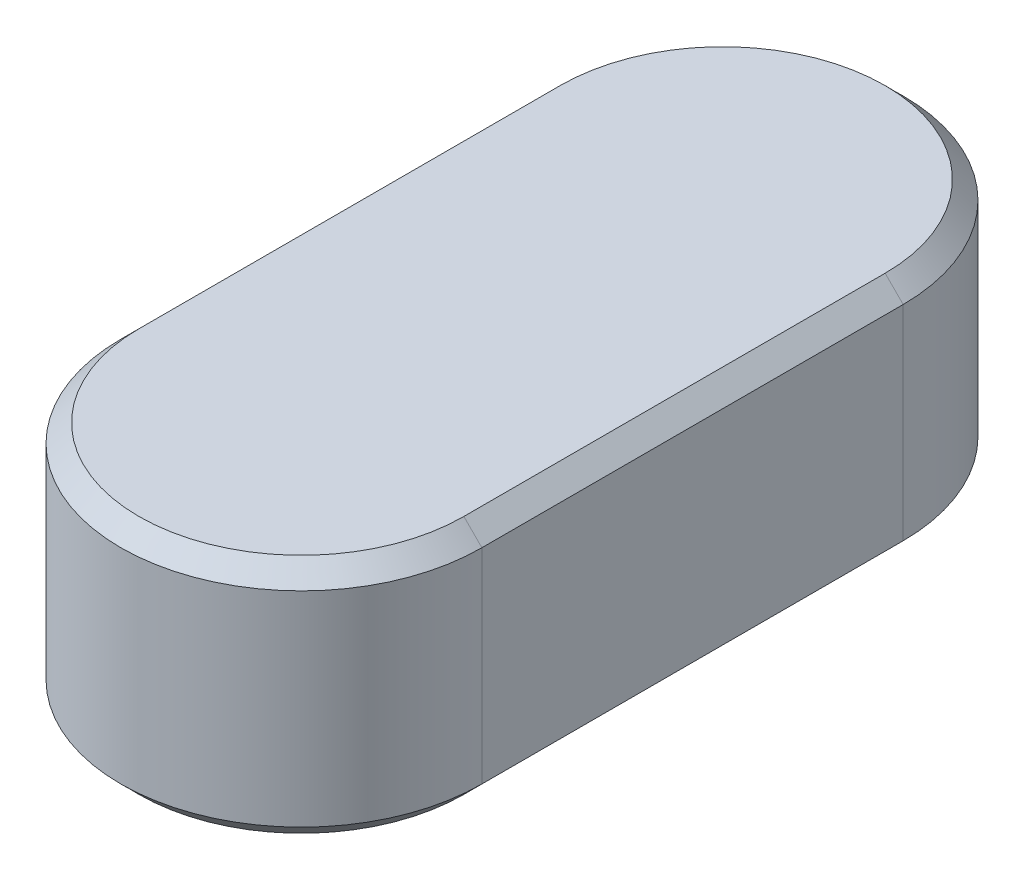
ISO-10303-21;
HEADER;
FILE_DESCRIPTION(('STEP AP214'),'2;1');
FILE_NAME('part.step','',(''),(''),'','','');
FILE_SCHEMA(('AUTOMOTIVE_DESIGN { 1 0 10303 214 1 1 1 1 }'));
ENDSEC;
DATA;
#1=APPLICATION_CONTEXT('core data for automotive mechanical design processes');
#2=APPLICATION_PROTOCOL_DEFINITION('international standard','automotive_design',2000,#1);
#3=PRODUCT_CONTEXT('',#1,'mechanical');
#4=PRODUCT('Part','Part','',(#3));
#5=PRODUCT_RELATED_PRODUCT_CATEGORY('part','',(#4));
#6=PRODUCT_DEFINITION_FORMATION('','',#4);
#7=PRODUCT_DEFINITION_CONTEXT('part definition',#1,'design');
#8=PRODUCT_DEFINITION('design','',#6,#7);
#9=PRODUCT_DEFINITION_SHAPE('','',#8);
#10=(LENGTH_UNIT() NAMED_UNIT(*) SI_UNIT(.MILLI.,.METRE.));
#11=(NAMED_UNIT(*) PLANE_ANGLE_UNIT() SI_UNIT($,.RADIAN.));
#12=(NAMED_UNIT(*) SI_UNIT($,.STERADIAN.) SOLID_ANGLE_UNIT());
#13=UNCERTAINTY_MEASURE_WITH_UNIT(LENGTH_MEASURE(1.E-05),#10,'distance_accuracy_value','');
#14=(GEOMETRIC_REPRESENTATION_CONTEXT(3) GLOBAL_UNCERTAINTY_ASSIGNED_CONTEXT((#13)) GLOBAL_UNIT_ASSIGNED_CONTEXT((#10,
#11,#12)) REPRESENTATION_CONTEXT('',''));
#15=CARTESIAN_POINT('',(0.,0.,0.));
#16=DIRECTION('',(0.,0.,1.));
#17=DIRECTION('',(1.,0.,0.));
#18=AXIS2_PLACEMENT_3D('',#15,#16,#17);
#19=CARTESIAN_POINT('',(0.,8.,0.));
#20=DIRECTION('',(0.,-1.,0.));
#21=DIRECTION('',(0.,0.,-1.));
#22=AXIS2_PLACEMENT_3D('',#19,#20,#21);
#23=CYLINDRICAL_SURFACE('',#22,6.);
#24=DIRECTION('',(0.,-1.,0.));
#25=VECTOR('',#24,1.);
#26=CARTESIAN_POINT('',(6.,8.,0.));
#27=LINE('',#26,#25);
#28=CARTESIAN_POINT('',(6.,7.4,0.));
#29=VERTEX_POINT('',#28);
#30=CARTESIAN_POINT('',(6.,0.600000000000003,0.));
#31=VERTEX_POINT('',#30);
#32=EDGE_CURVE('E137',#29,#31,#27,.T.);
#33=ORIENTED_EDGE('',*,*,#32,.F.);
#34=CARTESIAN_POINT('',(0.,7.4,0.));
#35=DIRECTION('',(0.,-1.,0.));
#36=DIRECTION('',(0.,0.,-1.));
#37=AXIS2_PLACEMENT_3D('',#34,#35,#36);
#38=CIRCLE('',#37,6.);
#39=CARTESIAN_POINT('',(-6.,7.4,0.));
#40=VERTEX_POINT('',#39);
#41=EDGE_CURVE('E140',#29,#40,#38,.T.);
#42=ORIENTED_EDGE('',*,*,#41,.T.);
#43=DIRECTION('',(0.,-1.,0.));
#44=VECTOR('',#43,1.);
#45=CARTESIAN_POINT('',(-6.,8.,0.));
#46=LINE('',#45,#44);
#47=CARTESIAN_POINT('',(-6.,0.600000000000003,0.));
#48=VERTEX_POINT('',#47);
#49=EDGE_CURVE('E146',#40,#48,#46,.T.);
#50=ORIENTED_EDGE('',*,*,#49,.T.);
#51=CARTESIAN_POINT('',(0.,0.600000000000003,0.));
#52=DIRECTION('',(0.,-1.,0.));
#53=DIRECTION('',(0.,0.,-1.));
#54=AXIS2_PLACEMENT_3D('',#51,#52,#53);
#55=CIRCLE('',#54,6.);
#56=EDGE_CURVE('E193',#48,#31,#55,.F.);
#57=ORIENTED_EDGE('',*,*,#56,.T.);
#58=EDGE_LOOP('',(#33,#42,#50,#57));
#59=FACE_BOUND('',#58,.T.);
#60=ADVANCED_FACE('F45',(#59),#23,.T.);
#61=CARTESIAN_POINT('',(6.,8.,0.));
#62=DIRECTION('',(-1.,0.,0.));
#63=DIRECTION('',(0.,0.,1.));
#64=AXIS2_PLACEMENT_3D('',#61,#62,#63);
#65=PLANE('',#64);
#66=DIRECTION('',(0.,-1.,0.));
#67=VECTOR('',#66,1.);
#68=CARTESIAN_POINT('',(6.,8.,-14.));
#69=LINE('',#68,#67);
#70=CARTESIAN_POINT('',(6.,7.4,-14.));
#71=VERTEX_POINT('',#70);
#72=CARTESIAN_POINT('',(6.,0.600000000000003,-14.));
#73=VERTEX_POINT('',#72);
#74=EDGE_CURVE('E211',#71,#73,#69,.T.);
#75=ORIENTED_EDGE('',*,*,#74,.F.);
#76=DIRECTION('',(0.,0.,1.));
#77=VECTOR('',#76,1.);
#78=CARTESIAN_POINT('',(6.,7.4,0.));
#79=LINE('',#78,#77);
#80=EDGE_CURVE('E179',#71,#29,#79,.T.);
#81=ORIENTED_EDGE('',*,*,#80,.T.);
#82=ORIENTED_EDGE('',*,*,#32,.T.);
#83=DIRECTION('',(0.,0.,-1.));
#84=VECTOR('',#83,1.);
#85=CARTESIAN_POINT('',(6.,0.600000000000003,-14.));
#86=LINE('',#85,#84);
#87=EDGE_CURVE('E182',#31,#73,#86,.T.);
#88=ORIENTED_EDGE('',*,*,#87,.T.);
#89=EDGE_LOOP('',(#75,#81,#82,#88));
#90=FACE_BOUND('',#89,.T.);
#91=ADVANCED_FACE('F236',(#90),#65,.F.);
#92=CARTESIAN_POINT('',(0.,8.,-14.));
#93=DIRECTION('',(0.,-1.,0.));
#94=DIRECTION('',(0.,0.,-1.));
#95=AXIS2_PLACEMENT_3D('',#92,#93,#94);
#96=CYLINDRICAL_SURFACE('',#95,6.);
#97=DIRECTION('',(0.,-1.,0.));
#98=VECTOR('',#97,1.);
#99=CARTESIAN_POINT('',(-6.,8.,-14.));
#100=LINE('',#99,#98);
#101=CARTESIAN_POINT('',(-6.,7.4,-14.));
#102=VERTEX_POINT('',#101);
#103=CARTESIAN_POINT('',(-6.,0.600000000000003,-14.));
#104=VERTEX_POINT('',#103);
#105=EDGE_CURVE('E215',#102,#104,#100,.T.);
#106=ORIENTED_EDGE('',*,*,#105,.F.);
#107=CARTESIAN_POINT('',(0.,7.4,-14.));
#108=DIRECTION('',(0.,-1.,0.));
#109=DIRECTION('',(0.,0.,-1.));
#110=AXIS2_PLACEMENT_3D('',#107,#108,#109);
#111=CIRCLE('',#110,6.);
#112=EDGE_CURVE('E185',#102,#71,#111,.T.);
#113=ORIENTED_EDGE('',*,*,#112,.T.);
#114=ORIENTED_EDGE('',*,*,#74,.T.);
#115=CARTESIAN_POINT('',(0.,0.600000000000003,-14.));
#116=DIRECTION('',(0.,-1.,0.));
#117=DIRECTION('',(0.,0.,-1.));
#118=AXIS2_PLACEMENT_3D('',#115,#116,#117);
#119=CIRCLE('',#118,6.);
#120=EDGE_CURVE('E188',#73,#104,#119,.F.);
#121=ORIENTED_EDGE('',*,*,#120,.T.);
#122=EDGE_LOOP('',(#106,#113,#114,#121));
#123=FACE_BOUND('',#122,.T.);
#124=ADVANCED_FACE('F234',(#123),#96,.T.);
#125=CARTESIAN_POINT('',(-6.,8.,0.));
#126=DIRECTION('',(1.,0.,0.));
#127=DIRECTION('',(0.,0.,-1.));
#128=AXIS2_PLACEMENT_3D('',#125,#126,#127);
#129=PLANE('',#128);
#130=ORIENTED_EDGE('',*,*,#49,.F.);
#131=DIRECTION('',(0.,0.,-1.));
#132=VECTOR('',#131,1.);
#133=CARTESIAN_POINT('',(-6.,7.4,0.));
#134=LINE('',#133,#132);
#135=EDGE_CURVE('E196',#40,#102,#134,.T.);
#136=ORIENTED_EDGE('',*,*,#135,.T.);
#137=ORIENTED_EDGE('',*,*,#105,.T.);
#138=DIRECTION('',(0.,0.,1.));
#139=VECTOR('',#138,1.);
#140=CARTESIAN_POINT('',(-6.,0.600000000000003,0.));
#141=LINE('',#140,#139);
#142=EDGE_CURVE('E200',#104,#48,#141,.T.);
#143=ORIENTED_EDGE('',*,*,#142,.T.);
#144=EDGE_LOOP('',(#130,#136,#137,#143));
#145=FACE_BOUND('',#144,.T.);
#146=ADVANCED_FACE('F225',(#145),#129,.F.);
#147=CARTESIAN_POINT('',(0.,8.,0.));
#148=DIRECTION('',(0.,-1.,0.));
#149=DIRECTION('',(0.,0.,-1.));
#150=AXIS2_PLACEMENT_3D('',#147,#148,#149);
#151=PLANE('',#150);
#152=CARTESIAN_POINT('',(0.,8.,-14.));
#153=DIRECTION('',(0.,-1.,0.));
#154=DIRECTION('',(0.,0.,-1.));
#155=AXIS2_PLACEMENT_3D('',#152,#153,#154);
#156=CIRCLE('',#155,5.4);
#157=CARTESIAN_POINT('',(5.4,8.,-14.));
#158=VERTEX_POINT('',#157);
#159=CARTESIAN_POINT('',(-5.4,8.,-14.));
#160=VERTEX_POINT('',#159);
#161=EDGE_CURVE('E125',#158,#160,#156,.F.);
#162=ORIENTED_EDGE('',*,*,#161,.T.);
#163=DIRECTION('',(0.,0.,1.));
#164=VECTOR('',#163,1.);
#165=CARTESIAN_POINT('',(-5.4,8.,0.));
#166=LINE('',#165,#164);
#167=CARTESIAN_POINT('',(-5.4,8.,0.));
#168=VERTEX_POINT('',#167);
#169=EDGE_CURVE('E120',#160,#168,#166,.T.);
#170=ORIENTED_EDGE('',*,*,#169,.T.);
#171=CARTESIAN_POINT('',(0.,8.,0.));
#172=DIRECTION('',(0.,-1.,0.));
#173=DIRECTION('',(0.,0.,-1.));
#174=AXIS2_PLACEMENT_3D('',#171,#172,#173);
#175=CIRCLE('',#174,5.4);
#176=CARTESIAN_POINT('',(5.4,8.,0.));
#177=VERTEX_POINT('',#176);
#178=EDGE_CURVE('E114',#168,#177,#175,.F.);
#179=ORIENTED_EDGE('',*,*,#178,.T.);
#180=DIRECTION('',(0.,0.,-1.));
#181=VECTOR('',#180,1.);
#182=CARTESIAN_POINT('',(5.4,8.,0.));
#183=LINE('',#182,#181);
#184=EDGE_CURVE('E117',#177,#158,#183,.T.);
#185=ORIENTED_EDGE('',*,*,#184,.T.);
#186=EDGE_LOOP('',(#162,#170,#179,#185));
#187=FACE_BOUND('',#186,.T.);
#188=ADVANCED_FACE('F116',(#187),#151,.F.);
#189=CARTESIAN_POINT('',(0.,0.,0.));
#190=DIRECTION('',(0.,-1.,0.));
#191=DIRECTION('',(0.,0.,-1.));
#192=AXIS2_PLACEMENT_3D('',#189,#190,#191);
#193=PLANE('',#192);
#194=CARTESIAN_POINT('',(0.,0.,0.));
#195=DIRECTION('',(0.,-1.,0.));
#196=DIRECTION('',(0.,0.,-1.));
#197=AXIS2_PLACEMENT_3D('',#194,#195,#196);
#198=CIRCLE('',#197,5.4);
#199=CARTESIAN_POINT('',(5.4,0.,0.));
#200=VERTEX_POINT('',#199);
#201=CARTESIAN_POINT('',(-5.4,0.,0.));
#202=VERTEX_POINT('',#201);
#203=EDGE_CURVE('E56',#200,#202,#198,.T.);
#204=ORIENTED_EDGE('',*,*,#203,.T.);
#205=DIRECTION('',(0.,0.,-1.));
#206=VECTOR('',#205,1.);
#207=CARTESIAN_POINT('',(-5.4,0.,-14.));
#208=LINE('',#207,#206);
#209=CARTESIAN_POINT('',(-5.4,0.,-14.));
#210=VERTEX_POINT('',#209);
#211=EDGE_CURVE('E11',#202,#210,#208,.T.);
#212=ORIENTED_EDGE('',*,*,#211,.T.);
#213=CARTESIAN_POINT('',(0.,0.,-14.));
#214=DIRECTION('',(0.,-1.,0.));
#215=DIRECTION('',(0.,0.,-1.));
#216=AXIS2_PLACEMENT_3D('',#213,#214,#215);
#217=CIRCLE('',#216,5.4);
#218=CARTESIAN_POINT('',(5.4,0.,-14.));
#219=VERTEX_POINT('',#218);
#220=EDGE_CURVE('E173',#210,#219,#217,.T.);
#221=ORIENTED_EDGE('',*,*,#220,.T.);
#222=DIRECTION('',(0.,0.,1.));
#223=VECTOR('',#222,1.);
#224=CARTESIAN_POINT('',(5.4,0.,0.));
#225=LINE('',#224,#223);
#226=EDGE_CURVE('E176',#219,#200,#225,.T.);
#227=ORIENTED_EDGE('',*,*,#226,.T.);
#228=EDGE_LOOP('',(#204,#212,#221,#227));
#229=FACE_BOUND('',#228,.T.);
#230=ADVANCED_FACE('F279',(#229),#193,.T.);
#231=CARTESIAN_POINT('',(5.4,8.,0.));
#232=DIRECTION('',(-0.707106781186548,-0.707106781186548,0.));
#233=DIRECTION('',(0.,0.,-1.));
#234=AXIS2_PLACEMENT_3D('',#231,#232,#233);
#235=PLANE('',#234);
#236=DIRECTION('',(-0.707106781186548,0.707106781186548,0.));
#237=VECTOR('',#236,1.);
#238=CARTESIAN_POINT('',(6.,7.4,0.));
#239=LINE('',#238,#237);
#240=EDGE_CURVE('E131',#29,#177,#239,.T.);
#241=ORIENTED_EDGE('',*,*,#240,.F.);
#242=ORIENTED_EDGE('',*,*,#80,.F.);
#243=DIRECTION('',(0.707106781186548,-0.707106781186548,0.));
#244=VECTOR('',#243,1.);
#245=CARTESIAN_POINT('',(5.4,8.,-14.));
#246=LINE('',#245,#244);
#247=EDGE_CURVE('E134',#158,#71,#246,.T.);
#248=ORIENTED_EDGE('',*,*,#247,.F.);
#249=ORIENTED_EDGE('',*,*,#184,.F.);
#250=EDGE_LOOP('',(#241,#242,#248,#249));
#251=FACE_BOUND('',#250,.T.);
#252=ADVANCED_FACE('F129',(#251),#235,.F.);
#253=CARTESIAN_POINT('',(0.,8.,-14.));
#254=DIRECTION('',(0.,-1.,0.));
#255=DIRECTION('',(0.,0.,-1.));
#256=AXIS2_PLACEMENT_3D('',#253,#254,#255);
#257=CONICAL_SURFACE('',#256,5.4,0.785398163397448);
#258=ORIENTED_EDGE('',*,*,#247,.T.);
#259=ORIENTED_EDGE('',*,*,#112,.F.);
#260=DIRECTION('',(-0.707106781186548,-0.707106781186548,0.));
#261=VECTOR('',#260,1.);
#262=CARTESIAN_POINT('',(-5.4,8.,-14.));
#263=LINE('',#262,#261);
#264=EDGE_CURVE('E142',#160,#102,#263,.T.);
#265=ORIENTED_EDGE('',*,*,#264,.F.);
#266=ORIENTED_EDGE('',*,*,#161,.F.);
#267=EDGE_LOOP('',(#258,#259,#265,#266));
#268=FACE_BOUND('',#267,.T.);
#269=ADVANCED_FACE('F231',(#268),#257,.T.);
#270=CARTESIAN_POINT('',(0.,8.,0.));
#271=DIRECTION('',(0.,-1.,0.));
#272=DIRECTION('',(0.,0.,-1.));
#273=AXIS2_PLACEMENT_3D('',#270,#271,#272);
#274=CONICAL_SURFACE('',#273,5.4,0.785398163397448);
#275=ORIENTED_EDGE('',*,*,#240,.T.);
#276=ORIENTED_EDGE('',*,*,#178,.F.);
#277=DIRECTION('',(0.707106781186548,0.707106781186548,0.));
#278=VECTOR('',#277,1.);
#279=CARTESIAN_POINT('',(-6.,7.4,0.));
#280=LINE('',#279,#278);
#281=EDGE_CURVE('E148',#40,#168,#280,.T.);
#282=ORIENTED_EDGE('',*,*,#281,.F.);
#283=ORIENTED_EDGE('',*,*,#41,.F.);
#284=EDGE_LOOP('',(#275,#276,#282,#283));
#285=FACE_BOUND('',#284,.T.);
#286=ADVANCED_FACE('F139',(#285),#274,.T.);
#287=CARTESIAN_POINT('',(-5.4,8.,0.));
#288=DIRECTION('',(0.707106781186548,-0.707106781186548,0.));
#289=DIRECTION('',(0.,0.,1.));
#290=AXIS2_PLACEMENT_3D('',#287,#288,#289);
#291=PLANE('',#290);
#292=ORIENTED_EDGE('',*,*,#264,.T.);
#293=ORIENTED_EDGE('',*,*,#135,.F.);
#294=ORIENTED_EDGE('',*,*,#281,.T.);
#295=ORIENTED_EDGE('',*,*,#169,.F.);
#296=EDGE_LOOP('',(#292,#293,#294,#295));
#297=FACE_BOUND('',#296,.T.);
#298=ADVANCED_FACE('F227',(#297),#291,.F.);
#299=CARTESIAN_POINT('',(6.,0.600000000000003,0.));
#300=DIRECTION('',(0.707106781186548,-0.707106781186548,0.));
#301=DIRECTION('',(0.,0.,1.));
#302=AXIS2_PLACEMENT_3D('',#299,#300,#301);
#303=PLANE('',#302);
#304=DIRECTION('',(0.707106781186548,0.707106781186548,0.));
#305=VECTOR('',#304,1.);
#306=CARTESIAN_POINT('',(5.4,0.,0.));
#307=LINE('',#306,#305);
#308=EDGE_CURVE('E156',#200,#31,#307,.T.);
#309=ORIENTED_EDGE('',*,*,#308,.F.);
#310=ORIENTED_EDGE('',*,*,#226,.F.);
#311=DIRECTION('',(-0.707106781186548,-0.707106781186548,0.));
#312=VECTOR('',#311,1.);
#313=CARTESIAN_POINT('',(6.,0.600000000000003,-14.));
#314=LINE('',#313,#312);
#315=EDGE_CURVE('E50',#73,#219,#314,.T.);
#316=ORIENTED_EDGE('',*,*,#315,.F.);
#317=ORIENTED_EDGE('',*,*,#87,.F.);
#318=EDGE_LOOP('',(#309,#310,#316,#317));
#319=FACE_BOUND('',#318,.T.);
#320=ADVANCED_FACE('F48',(#319),#303,.T.);
#321=CARTESIAN_POINT('',(0.,0.600000000000003,-14.));
#322=DIRECTION('',(0.,1.,0.));
#323=DIRECTION('',(0.,0.,1.));
#324=AXIS2_PLACEMENT_3D('',#321,#322,#323);
#325=CONICAL_SURFACE('',#324,6.,0.785398163397448);
#326=ORIENTED_EDGE('',*,*,#315,.T.);
#327=ORIENTED_EDGE('',*,*,#220,.F.);
#328=DIRECTION('',(0.707106781186548,-0.707106781186548,0.));
#329=VECTOR('',#328,1.);
#330=CARTESIAN_POINT('',(-6.,0.600000000000003,-14.));
#331=LINE('',#330,#329);
#332=EDGE_CURVE('E69',#104,#210,#331,.T.);
#333=ORIENTED_EDGE('',*,*,#332,.F.);
#334=ORIENTED_EDGE('',*,*,#120,.F.);
#335=EDGE_LOOP('',(#326,#327,#333,#334));
#336=FACE_BOUND('',#335,.T.);
#337=ADVANCED_FACE('F240',(#336),#325,.T.);
#338=CARTESIAN_POINT('',(0.,0.600000000000003,0.));
#339=DIRECTION('',(0.,1.,0.));
#340=DIRECTION('',(0.,0.,1.));
#341=AXIS2_PLACEMENT_3D('',#338,#339,#340);
#342=CONICAL_SURFACE('',#341,6.,0.785398163397448);
#343=ORIENTED_EDGE('',*,*,#308,.T.);
#344=ORIENTED_EDGE('',*,*,#56,.F.);
#345=DIRECTION('',(-0.707106781186548,0.707106781186548,0.));
#346=VECTOR('',#345,1.);
#347=CARTESIAN_POINT('',(-5.4,0.,0.));
#348=LINE('',#347,#346);
#349=EDGE_CURVE('E152',#202,#48,#348,.T.);
#350=ORIENTED_EDGE('',*,*,#349,.F.);
#351=ORIENTED_EDGE('',*,*,#203,.F.);
#352=EDGE_LOOP('',(#343,#344,#350,#351));
#353=FACE_BOUND('',#352,.T.);
#354=ADVANCED_FACE('F243',(#353),#342,.T.);
#355=CARTESIAN_POINT('',(-6.,0.600000000000003,0.));
#356=DIRECTION('',(-0.707106781186548,-0.707106781186548,0.));
#357=DIRECTION('',(0.,0.,-1.));
#358=AXIS2_PLACEMENT_3D('',#355,#356,#357);
#359=PLANE('',#358);
#360=ORIENTED_EDGE('',*,*,#332,.T.);
#361=ORIENTED_EDGE('',*,*,#211,.F.);
#362=ORIENTED_EDGE('',*,*,#349,.T.);
#363=ORIENTED_EDGE('',*,*,#142,.F.);
#364=EDGE_LOOP('',(#360,#361,#362,#363));
#365=FACE_BOUND('',#364,.T.);
#366=ADVANCED_FACE('F241',(#365),#359,.T.);
#367=CLOSED_SHELL('',(#60,#91,#124,#146,#188,#230,#252,#269,#286,#298,#320,#337,#354,#366));
#368=MANIFOLD_SOLID_BREP('B2',#367);
#369=ADVANCED_BREP_SHAPE_REPRESENTATION('',(#18,#368),#14);
#370=SHAPE_DEFINITION_REPRESENTATION(#9,#369);
ENDSEC;
END-ISO-10303-21;
